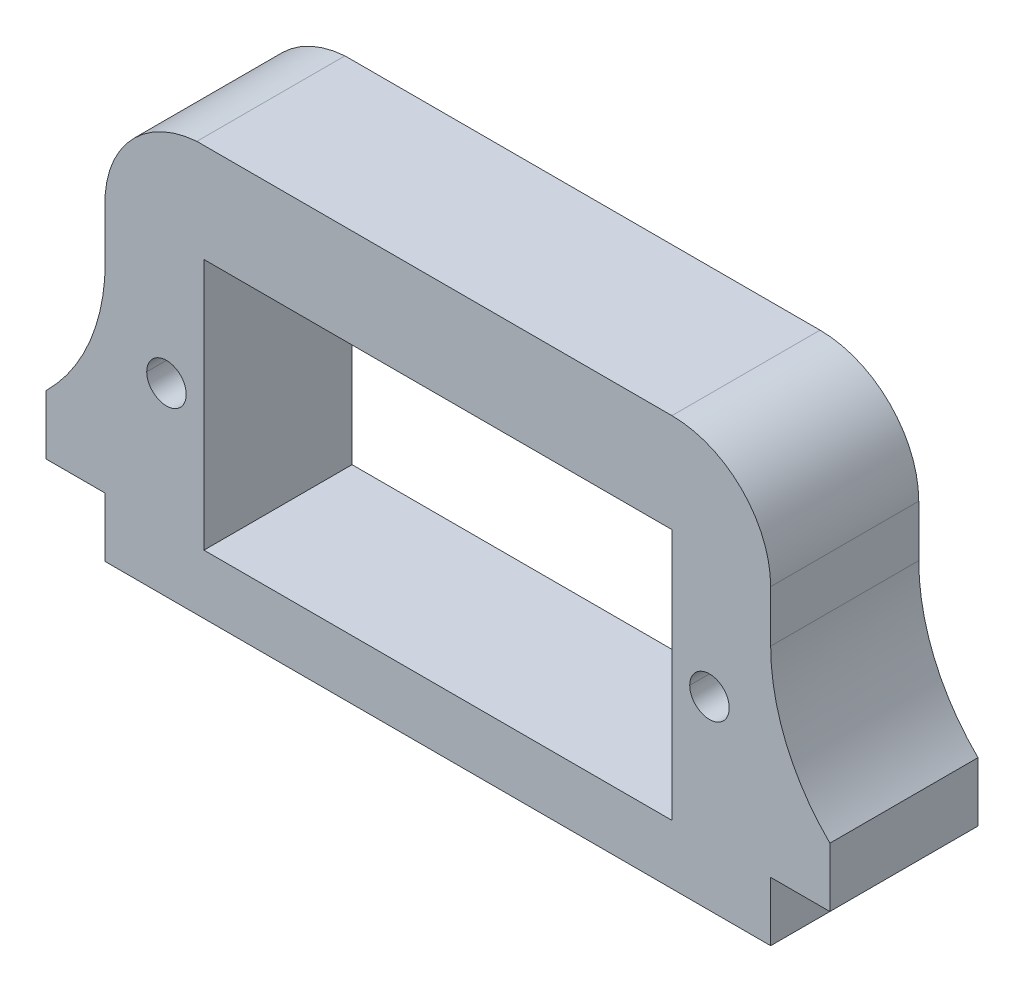
ISO-10303-21;
HEADER;
FILE_DESCRIPTION(('STEP AP214'),'2;1');
FILE_NAME('part.step','',(''),(''),'','','');
FILE_SCHEMA(('AUTOMOTIVE_DESIGN { 1 0 10303 214 1 1 1 1 }'));
ENDSEC;
DATA;
#1=APPLICATION_CONTEXT('core data for automotive mechanical design processes');
#2=APPLICATION_PROTOCOL_DEFINITION('international standard','automotive_design',2000,#1);
#3=PRODUCT_CONTEXT('',#1,'mechanical');
#4=PRODUCT('Part','Part','',(#3));
#5=PRODUCT_RELATED_PRODUCT_CATEGORY('part','',(#4));
#6=PRODUCT_DEFINITION_FORMATION('','',#4);
#7=PRODUCT_DEFINITION_CONTEXT('part definition',#1,'design');
#8=PRODUCT_DEFINITION('design','',#6,#7);
#9=PRODUCT_DEFINITION_SHAPE('','',#8);
#10=(LENGTH_UNIT() NAMED_UNIT(*) SI_UNIT(.MILLI.,.METRE.));
#11=(NAMED_UNIT(*) PLANE_ANGLE_UNIT() SI_UNIT($,.RADIAN.));
#12=(NAMED_UNIT(*) SI_UNIT($,.STERADIAN.) SOLID_ANGLE_UNIT());
#13=UNCERTAINTY_MEASURE_WITH_UNIT(LENGTH_MEASURE(1.E-05),#10,'distance_accuracy_value','');
#14=(GEOMETRIC_REPRESENTATION_CONTEXT(3) GLOBAL_UNCERTAINTY_ASSIGNED_CONTEXT((#13)) GLOBAL_UNIT_ASSIGNED_CONTEXT((#10,
#11,#12)) REPRESENTATION_CONTEXT('',''));
#15=CARTESIAN_POINT('',(0.,0.,0.));
#16=DIRECTION('',(0.,0.,1.));
#17=DIRECTION('',(1.,0.,0.));
#18=AXIS2_PLACEMENT_3D('',#15,#16,#17);
#19=CARTESIAN_POINT('',(-10.,13.1414284285428,7.5));
#20=DIRECTION('',(0.,0.,-1.));
#21=DIRECTION('',(-1.,0.,0.));
#22=AXIS2_PLACEMENT_3D('',#19,#20,#21);
#23=CYLINDRICAL_SURFACE('',#22,10.);
#24=CARTESIAN_POINT('',(-10.,13.1414284285428,7.5));
#25=DIRECTION('',(0.,0.,-1.));
#26=DIRECTION('',(1.,0.,0.));
#27=AXIS2_PLACEMENT_3D('',#24,#25,#26);
#28=CIRCLE('',#27,10.);
#29=CARTESIAN_POINT('',(0.,13.1414284285428,7.5));
#30=VERTEX_POINT('',#29);
#31=CARTESIAN_POINT('',(-3.,6.,7.5));
#32=VERTEX_POINT('',#31);
#33=EDGE_CURVE('E261',#30,#32,#28,.T.);
#34=ORIENTED_EDGE('',*,*,#33,.F.);
#35=DIRECTION('',(0.,0.,1.));
#36=VECTOR('',#35,1.);
#37=CARTESIAN_POINT('',(0.,13.1414284285428,7.5));
#38=LINE('',#37,#36);
#39=CARTESIAN_POINT('',(0.,13.1414284285428,0.));
#40=VERTEX_POINT('',#39);
#41=EDGE_CURVE('E220',#40,#30,#38,.T.);
#42=ORIENTED_EDGE('',*,*,#41,.F.);
#43=CARTESIAN_POINT('',(-10.,13.1414284285428,0.));
#44=DIRECTION('',(0.,0.,1.));
#45=DIRECTION('',(1.,0.,0.));
#46=AXIS2_PLACEMENT_3D('',#43,#44,#45);
#47=CIRCLE('',#46,10.);
#48=CARTESIAN_POINT('',(-3.,6.,0.));
#49=VERTEX_POINT('',#48);
#50=EDGE_CURVE('E218',#49,#40,#47,.T.);
#51=ORIENTED_EDGE('',*,*,#50,.F.);
#52=DIRECTION('',(0.,0.,-1.));
#53=VECTOR('',#52,1.);
#54=CARTESIAN_POINT('',(-3.,6.,7.5));
#55=LINE('',#54,#53);
#56=EDGE_CURVE('E9',#32,#49,#55,.T.);
#57=ORIENTED_EDGE('',*,*,#56,.F.);
#58=EDGE_LOOP('',(#34,#42,#51,#57));
#59=FACE_BOUND('',#58,.T.);
#60=ADVANCED_FACE('F14',(#59),#23,.F.);
#61=CARTESIAN_POINT('',(43.7,13.1414284285429,7.5));
#62=DIRECTION('',(0.,0.,1.));
#63=DIRECTION('',(1.,0.,0.));
#64=AXIS2_PLACEMENT_3D('',#61,#62,#63);
#65=CYLINDRICAL_SURFACE('',#64,10.);
#66=CARTESIAN_POINT('',(43.7,13.1414284285429,7.5));
#67=DIRECTION('',(0.,0.,-1.));
#68=DIRECTION('',(1.,0.,0.));
#69=AXIS2_PLACEMENT_3D('',#66,#67,#68);
#70=CIRCLE('',#69,10.);
#71=CARTESIAN_POINT('',(36.7,6.,7.5));
#72=VERTEX_POINT('',#71);
#73=CARTESIAN_POINT('',(33.7,13.1414284285429,7.5));
#74=VERTEX_POINT('',#73);
#75=EDGE_CURVE('E346',#72,#74,#70,.T.);
#76=ORIENTED_EDGE('',*,*,#75,.F.);
#77=DIRECTION('',(0.,0.,-1.));
#78=VECTOR('',#77,1.);
#79=CARTESIAN_POINT('',(36.7,6.,7.5));
#80=LINE('',#79,#78);
#81=CARTESIAN_POINT('',(36.7,6.,0.));
#82=VERTEX_POINT('',#81);
#83=EDGE_CURVE('E272',#72,#82,#80,.T.);
#84=ORIENTED_EDGE('',*,*,#83,.T.);
#85=CARTESIAN_POINT('',(43.7,13.1414284285429,0.));
#86=DIRECTION('',(0.,0.,1.));
#87=DIRECTION('',(1.,0.,0.));
#88=AXIS2_PLACEMENT_3D('',#85,#86,#87);
#89=CIRCLE('',#88,10.);
#90=CARTESIAN_POINT('',(33.7,13.1414284285429,0.));
#91=VERTEX_POINT('',#90);
#92=EDGE_CURVE('E362',#91,#82,#89,.T.);
#93=ORIENTED_EDGE('',*,*,#92,.F.);
#94=DIRECTION('',(0.,0.,-1.));
#95=VECTOR('',#94,1.);
#96=CARTESIAN_POINT('',(33.7,13.1414284285429,7.5));
#97=LINE('',#96,#95);
#98=EDGE_CURVE('E252',#74,#91,#97,.T.);
#99=ORIENTED_EDGE('',*,*,#98,.F.);
#100=EDGE_LOOP('',(#76,#84,#93,#99));
#101=FACE_BOUND('',#100,.T.);
#102=ADVANCED_FACE('F630',(#101),#65,.F.);
#103=CARTESIAN_POINT('',(-3.,3.,7.5));
#104=DIRECTION('',(-1.,0.,0.));
#105=DIRECTION('',(0.,0.,1.));
#106=AXIS2_PLACEMENT_3D('',#103,#104,#105);
#107=PLANE('',#106);
#108=DIRECTION('',(0.,1.,0.));
#109=VECTOR('',#108,1.);
#110=CARTESIAN_POINT('',(-3.,3.,0.));
#111=LINE('',#110,#109);
#112=CARTESIAN_POINT('',(-3.,3.,0.));
#113=VERTEX_POINT('',#112);
#114=EDGE_CURVE('E210',#113,#49,#111,.T.);
#115=ORIENTED_EDGE('',*,*,#114,.F.);
#116=DIRECTION('',(0.,0.,-1.));
#117=VECTOR('',#116,1.);
#118=CARTESIAN_POINT('',(-3.,3.,7.5));
#119=LINE('',#118,#117);
#120=CARTESIAN_POINT('',(-3.,3.,7.5));
#121=VERTEX_POINT('',#120);
#122=EDGE_CURVE('E24',#121,#113,#119,.T.);
#123=ORIENTED_EDGE('',*,*,#122,.F.);
#124=DIRECTION('',(0.,1.,0.));
#125=VECTOR('',#124,1.);
#126=CARTESIAN_POINT('',(-3.,3.,7.5));
#127=LINE('',#126,#125);
#128=EDGE_CURVE('E213',#121,#32,#127,.T.);
#129=ORIENTED_EDGE('',*,*,#128,.T.);
#130=ORIENTED_EDGE('',*,*,#56,.T.);
#131=EDGE_LOOP('',(#115,#123,#129,#130));
#132=FACE_BOUND('',#131,.T.);
#133=ADVANCED_FACE('F208',(#132),#107,.T.);
#134=CARTESIAN_POINT('',(0.,3.,7.5));
#135=DIRECTION('',(0.,-1.,0.));
#136=DIRECTION('',(0.,0.,-1.));
#137=AXIS2_PLACEMENT_3D('',#134,#135,#136);
#138=PLANE('',#137);
#139=DIRECTION('',(-1.,0.,0.));
#140=VECTOR('',#139,1.);
#141=CARTESIAN_POINT('',(0.,3.,0.));
#142=LINE('',#141,#140);
#143=CARTESIAN_POINT('',(0.,3.,0.));
#144=VERTEX_POINT('',#143);
#145=EDGE_CURVE('E228',#144,#113,#142,.T.);
#146=ORIENTED_EDGE('',*,*,#145,.F.);
#147=DIRECTION('',(0.,0.,-1.));
#148=VECTOR('',#147,1.);
#149=CARTESIAN_POINT('',(0.,3.,7.5));
#150=LINE('',#149,#148);
#151=CARTESIAN_POINT('',(0.,3.,7.5));
#152=VERTEX_POINT('',#151);
#153=EDGE_CURVE('E38',#152,#144,#150,.T.);
#154=ORIENTED_EDGE('',*,*,#153,.F.);
#155=DIRECTION('',(-1.,0.,0.));
#156=VECTOR('',#155,1.);
#157=CARTESIAN_POINT('',(0.,3.,7.5));
#158=LINE('',#157,#156);
#159=EDGE_CURVE('E388',#152,#121,#158,.T.);
#160=ORIENTED_EDGE('',*,*,#159,.T.);
#161=ORIENTED_EDGE('',*,*,#122,.T.);
#162=EDGE_LOOP('',(#146,#154,#160,#161));
#163=FACE_BOUND('',#162,.T.);
#164=ADVANCED_FACE('F406',(#163),#138,.T.);
#165=CARTESIAN_POINT('',(0.,0.,7.5));
#166=DIRECTION('',(-1.,0.,0.));
#167=DIRECTION('',(0.,0.,1.));
#168=AXIS2_PLACEMENT_3D('',#165,#166,#167);
#169=PLANE('',#168);
#170=DIRECTION('',(0.,1.,0.));
#171=VECTOR('',#170,1.);
#172=CARTESIAN_POINT('',(0.,0.,0.));
#173=LINE('',#172,#171);
#174=CARTESIAN_POINT('',(0.,16.1104121770289,0.));
#175=VERTEX_POINT('',#174);
#176=EDGE_CURVE('E224',#40,#175,#173,.T.);
#177=ORIENTED_EDGE('',*,*,#176,.F.);
#178=ORIENTED_EDGE('',*,*,#41,.T.);
#179=DIRECTION('',(0.,1.,0.));
#180=VECTOR('',#179,1.);
#181=CARTESIAN_POINT('',(0.,0.,7.5));
#182=LINE('',#181,#180);
#183=CARTESIAN_POINT('',(0.,16.1104121770289,7.5));
#184=VERTEX_POINT('',#183);
#185=EDGE_CURVE('E258',#30,#184,#182,.T.);
#186=ORIENTED_EDGE('',*,*,#185,.T.);
#187=DIRECTION('',(0.,0.,-1.));
#188=VECTOR('',#187,1.);
#189=CARTESIAN_POINT('',(0.,16.1104121770289,7.5));
#190=LINE('',#189,#188);
#191=EDGE_CURVE('E245',#184,#175,#190,.T.);
#192=ORIENTED_EDGE('',*,*,#191,.T.);
#193=EDGE_LOOP('',(#177,#178,#186,#192));
#194=FACE_BOUND('',#193,.T.);
#195=ADVANCED_FACE('F666',(#194),#169,.T.);
#196=CARTESIAN_POINT('',(0.,0.,7.5));
#197=DIRECTION('',(-1.,0.,0.));
#198=DIRECTION('',(0.,0.,1.));
#199=AXIS2_PLACEMENT_3D('',#196,#197,#198);
#200=PLANE('',#199);
#201=DIRECTION('',(0.,1.,0.));
#202=VECTOR('',#201,1.);
#203=CARTESIAN_POINT('',(0.,0.,7.5));
#204=LINE('',#203,#202);
#205=CARTESIAN_POINT('',(0.,0.,7.5));
#206=VERTEX_POINT('',#205);
#207=EDGE_CURVE('E349',#206,#152,#204,.T.);
#208=ORIENTED_EDGE('',*,*,#207,.T.);
#209=ORIENTED_EDGE('',*,*,#153,.T.);
#210=DIRECTION('',(0.,1.,0.));
#211=VECTOR('',#210,1.);
#212=CARTESIAN_POINT('',(0.,0.,0.));
#213=LINE('',#212,#211);
#214=CARTESIAN_POINT('',(0.,0.,0.));
#215=VERTEX_POINT('',#214);
#216=EDGE_CURVE('E236',#215,#144,#213,.T.);
#217=ORIENTED_EDGE('',*,*,#216,.F.);
#218=DIRECTION('',(0.,0.,-1.));
#219=VECTOR('',#218,1.);
#220=CARTESIAN_POINT('',(0.,0.,7.5));
#221=LINE('',#220,#219);
#222=EDGE_CURVE('E358',#206,#215,#221,.T.);
#223=ORIENTED_EDGE('',*,*,#222,.F.);
#224=EDGE_LOOP('',(#208,#209,#217,#223));
#225=FACE_BOUND('',#224,.T.);
#226=ADVANCED_FACE('F403',(#225),#200,.T.);
#227=CARTESIAN_POINT('',(0.,0.,7.5));
#228=DIRECTION('',(0.,0.,1.));
#229=DIRECTION('',(1.,0.,0.));
#230=AXIS2_PLACEMENT_3D('',#227,#228,#229);
#231=PLANE('',#230);
#232=DIRECTION('',(0.,1.,0.));
#233=VECTOR('',#232,1.);
#234=CARTESIAN_POINT('',(28.7,0.,7.5));
#235=LINE('',#234,#233);
#236=CARTESIAN_POINT('',(28.7,3.,7.5));
#237=VERTEX_POINT('',#236);
#238=CARTESIAN_POINT('',(28.7,15.75,7.5));
#239=VERTEX_POINT('',#238);
#240=EDGE_CURVE('E262',#237,#239,#235,.T.);
#241=ORIENTED_EDGE('',*,*,#240,.F.);
#242=DIRECTION('',(1.,0.,0.));
#243=VECTOR('',#242,1.);
#244=CARTESIAN_POINT('',(0.,3.,7.5));
#245=LINE('',#244,#243);
#246=CARTESIAN_POINT('',(5.,3.,7.5));
#247=VERTEX_POINT('',#246);
#248=EDGE_CURVE('E312',#247,#237,#245,.T.);
#249=ORIENTED_EDGE('',*,*,#248,.F.);
#250=DIRECTION('',(0.,1.,0.));
#251=VECTOR('',#250,1.);
#252=CARTESIAN_POINT('',(5.,0.,7.5));
#253=LINE('',#252,#251);
#254=CARTESIAN_POINT('',(5.,15.75,7.5));
#255=VERTEX_POINT('',#254);
#256=EDGE_CURVE('E276',#247,#255,#253,.T.);
#257=ORIENTED_EDGE('',*,*,#256,.T.);
#258=DIRECTION('',(1.,0.,0.));
#259=VECTOR('',#258,1.);
#260=CARTESIAN_POINT('',(0.,15.75,7.5));
#261=LINE('',#260,#259);
#262=EDGE_CURVE('E329',#255,#239,#261,.T.);
#263=ORIENTED_EDGE('',*,*,#262,.T.);
#264=EDGE_LOOP('',(#241,#249,#257,#263));
#265=FACE_BOUND('',#264,.T.);
#266=CARTESIAN_POINT('',(3.1,9.375,7.5));
#267=DIRECTION('',(0.,0.,1.));
#268=DIRECTION('',(1.,0.,0.));
#269=AXIS2_PLACEMENT_3D('',#266,#267,#268);
#270=CIRCLE('',#269,1.);
#271=CARTESIAN_POINT('',(2.1,9.375,7.5));
#272=VERTEX_POINT('',#271);
#273=CARTESIAN_POINT('',(4.1,9.375,7.5));
#274=VERTEX_POINT('',#273);
#275=EDGE_CURVE('E291',#272,#274,#270,.T.);
#276=ORIENTED_EDGE('',*,*,#275,.F.);
#277=CARTESIAN_POINT('',(3.1,9.375,7.5));
#278=DIRECTION('',(0.,0.,1.));
#279=DIRECTION('',(1.,0.,0.));
#280=AXIS2_PLACEMENT_3D('',#277,#278,#279);
#281=CIRCLE('',#280,1.);
#282=EDGE_CURVE('E265',#274,#272,#281,.T.);
#283=ORIENTED_EDGE('',*,*,#282,.F.);
#284=EDGE_LOOP('',(#276,#283));
#285=FACE_BOUND('',#284,.T.);
#286=CARTESIAN_POINT('',(30.6,9.375,7.5));
#287=DIRECTION('',(0.,0.,1.));
#288=DIRECTION('',(1.,0.,0.));
#289=AXIS2_PLACEMENT_3D('',#286,#287,#288);
#290=CIRCLE('',#289,1.);
#291=CARTESIAN_POINT('',(29.6,9.375,7.5));
#292=VERTEX_POINT('',#291);
#293=CARTESIAN_POINT('',(31.6,9.375,7.5));
#294=VERTEX_POINT('',#293);
#295=EDGE_CURVE('E384',#292,#294,#290,.T.);
#296=ORIENTED_EDGE('',*,*,#295,.F.);
#297=CARTESIAN_POINT('',(30.6,9.375,7.5));
#298=DIRECTION('',(0.,0.,1.));
#299=DIRECTION('',(1.,0.,0.));
#300=AXIS2_PLACEMENT_3D('',#297,#298,#299);
#301=CIRCLE('',#300,1.);
#302=EDGE_CURVE('E320',#294,#292,#301,.T.);
#303=ORIENTED_EDGE('',*,*,#302,.F.);
#304=EDGE_LOOP('',(#296,#303));
#305=FACE_BOUND('',#304,.T.);
#306=CARTESIAN_POINT('',(28.7,15.75,7.5));
#307=DIRECTION('',(0.,0.,-1.));
#308=DIRECTION('',(1.,0.,0.));
#309=AXIS2_PLACEMENT_3D('',#306,#307,#308);
#310=CIRCLE('',#309,5.);
#311=CARTESIAN_POINT('',(28.7,20.75,7.5));
#312=VERTEX_POINT('',#311);
#313=CARTESIAN_POINT('',(33.7,15.75,7.5));
#314=VERTEX_POINT('',#313);
#315=EDGE_CURVE('E297',#312,#314,#310,.T.);
#316=ORIENTED_EDGE('',*,*,#315,.F.);
#317=DIRECTION('',(1.,0.,0.));
#318=VECTOR('',#317,1.);
#319=CARTESIAN_POINT('',(0.,20.75,7.5));
#320=LINE('',#319,#318);
#321=CARTESIAN_POINT('',(4.63958782297116,20.75,7.5));
#322=VERTEX_POINT('',#321);
#323=EDGE_CURVE('E251',#322,#312,#320,.T.);
#324=ORIENTED_EDGE('',*,*,#323,.F.);
#325=CARTESIAN_POINT('',(5.,15.75,7.5));
#326=DIRECTION('',(0.,0.,-1.));
#327=DIRECTION('',(1.,0.,0.));
#328=AXIS2_PLACEMENT_3D('',#325,#326,#327);
#329=CIRCLE('',#328,5.01297286421448);
#330=EDGE_CURVE('E242',#184,#322,#329,.T.);
#331=ORIENTED_EDGE('',*,*,#330,.F.);
#332=ORIENTED_EDGE('',*,*,#185,.F.);
#333=ORIENTED_EDGE('',*,*,#33,.T.);
#334=ORIENTED_EDGE('',*,*,#128,.F.);
#335=ORIENTED_EDGE('',*,*,#159,.F.);
#336=ORIENTED_EDGE('',*,*,#207,.F.);
#337=DIRECTION('',(1.,0.,0.));
#338=VECTOR('',#337,1.);
#339=CARTESIAN_POINT('',(0.,0.,7.5));
#340=LINE('',#339,#338);
#341=CARTESIAN_POINT('',(33.7,0.,7.5));
#342=VERTEX_POINT('',#341);
#343=EDGE_CURVE('E363',#206,#342,#340,.T.);
#344=ORIENTED_EDGE('',*,*,#343,.T.);
#345=DIRECTION('',(0.,1.,0.));
#346=VECTOR('',#345,1.);
#347=CARTESIAN_POINT('',(33.7,0.,7.5));
#348=LINE('',#347,#346);
#349=CARTESIAN_POINT('',(33.7,3.,7.5));
#350=VERTEX_POINT('',#349);
#351=EDGE_CURVE('E278',#342,#350,#348,.T.);
#352=ORIENTED_EDGE('',*,*,#351,.T.);
#353=DIRECTION('',(1.,0.,0.));
#354=VECTOR('',#353,1.);
#355=CARTESIAN_POINT('',(0.,3.,7.5));
#356=LINE('',#355,#354);
#357=CARTESIAN_POINT('',(36.7,3.,7.5));
#358=VERTEX_POINT('',#357);
#359=EDGE_CURVE('E326',#350,#358,#356,.T.);
#360=ORIENTED_EDGE('',*,*,#359,.T.);
#361=DIRECTION('',(0.,1.,0.));
#362=VECTOR('',#361,1.);
#363=CARTESIAN_POINT('',(36.7,0.,7.5));
#364=LINE('',#363,#362);
#365=EDGE_CURVE('E267',#358,#72,#364,.T.);
#366=ORIENTED_EDGE('',*,*,#365,.T.);
#367=ORIENTED_EDGE('',*,*,#75,.T.);
#368=DIRECTION('',(0.,1.,0.));
#369=VECTOR('',#368,1.);
#370=CARTESIAN_POINT('',(33.7,0.,7.5));
#371=LINE('',#370,#369);
#372=EDGE_CURVE('E257',#74,#314,#371,.T.);
#373=ORIENTED_EDGE('',*,*,#372,.T.);
#374=EDGE_LOOP('',(#316,#324,#331,#332,#333,#334,#335,#336,#344,#352,#360,#366,#367,#373));
#375=FACE_BOUND('',#374,.T.);
#376=ADVANCED_FACE('F618',(#265,#285,#305,#375),#231,.T.);
#377=CARTESIAN_POINT('',(0.,0.,0.));
#378=DIRECTION('',(0.,0.,1.));
#379=DIRECTION('',(1.,0.,0.));
#380=AXIS2_PLACEMENT_3D('',#377,#378,#379);
#381=PLANE('',#380);
#382=DIRECTION('',(0.,1.,0.));
#383=VECTOR('',#382,1.);
#384=CARTESIAN_POINT('',(28.7,0.,0.));
#385=LINE('',#384,#383);
#386=CARTESIAN_POINT('',(28.7,3.,0.));
#387=VERTEX_POINT('',#386);
#388=CARTESIAN_POINT('',(28.7,15.75,0.));
#389=VERTEX_POINT('',#388);
#390=EDGE_CURVE('E266',#387,#389,#385,.T.);
#391=ORIENTED_EDGE('',*,*,#390,.T.);
#392=DIRECTION('',(1.,0.,0.));
#393=VECTOR('',#392,1.);
#394=CARTESIAN_POINT('',(0.,15.75,0.));
#395=LINE('',#394,#393);
#396=CARTESIAN_POINT('',(5.,15.75,0.));
#397=VERTEX_POINT('',#396);
#398=EDGE_CURVE('E370',#397,#389,#395,.T.);
#399=ORIENTED_EDGE('',*,*,#398,.F.);
#400=DIRECTION('',(0.,1.,0.));
#401=VECTOR('',#400,1.);
#402=CARTESIAN_POINT('',(5.,0.,0.));
#403=LINE('',#402,#401);
#404=CARTESIAN_POINT('',(5.,3.,0.));
#405=VERTEX_POINT('',#404);
#406=EDGE_CURVE('E273',#405,#397,#403,.T.);
#407=ORIENTED_EDGE('',*,*,#406,.F.);
#408=DIRECTION('',(1.,0.,0.));
#409=VECTOR('',#408,1.);
#410=CARTESIAN_POINT('',(0.,3.,0.));
#411=LINE('',#410,#409);
#412=EDGE_CURVE('E287',#405,#387,#411,.T.);
#413=ORIENTED_EDGE('',*,*,#412,.T.);
#414=EDGE_LOOP('',(#391,#399,#407,#413));
#415=FACE_BOUND('',#414,.T.);
#416=CARTESIAN_POINT('',(3.1,9.375,0.));
#417=DIRECTION('',(0.,0.,1.));
#418=DIRECTION('',(1.,0.,0.));
#419=AXIS2_PLACEMENT_3D('',#416,#417,#418);
#420=CIRCLE('',#419,1.);
#421=CARTESIAN_POINT('',(2.1,9.375,0.));
#422=VERTEX_POINT('',#421);
#423=CARTESIAN_POINT('',(4.1,9.375,0.));
#424=VERTEX_POINT('',#423);
#425=EDGE_CURVE('E355',#422,#424,#420,.T.);
#426=ORIENTED_EDGE('',*,*,#425,.T.);
#427=CARTESIAN_POINT('',(3.1,9.375,0.));
#428=DIRECTION('',(0.,0.,1.));
#429=DIRECTION('',(1.,0.,0.));
#430=AXIS2_PLACEMENT_3D('',#427,#428,#429);
#431=CIRCLE('',#430,1.);
#432=EDGE_CURVE('E393',#424,#422,#431,.T.);
#433=ORIENTED_EDGE('',*,*,#432,.T.);
#434=EDGE_LOOP('',(#426,#433));
#435=FACE_BOUND('',#434,.T.);
#436=CARTESIAN_POINT('',(30.6,9.375,0.));
#437=DIRECTION('',(0.,0.,1.));
#438=DIRECTION('',(1.,0.,0.));
#439=AXIS2_PLACEMENT_3D('',#436,#437,#438);
#440=CIRCLE('',#439,1.);
#441=CARTESIAN_POINT('',(29.6,9.375,0.));
#442=VERTEX_POINT('',#441);
#443=CARTESIAN_POINT('',(31.6,9.375,0.));
#444=VERTEX_POINT('',#443);
#445=EDGE_CURVE('E321',#442,#444,#440,.T.);
#446=ORIENTED_EDGE('',*,*,#445,.T.);
#447=CARTESIAN_POINT('',(30.6,9.375,0.));
#448=DIRECTION('',(0.,0.,1.));
#449=DIRECTION('',(1.,0.,0.));
#450=AXIS2_PLACEMENT_3D('',#447,#448,#449);
#451=CIRCLE('',#450,1.);
#452=EDGE_CURVE('E317',#444,#442,#451,.T.);
#453=ORIENTED_EDGE('',*,*,#452,.T.);
#454=EDGE_LOOP('',(#446,#453));
#455=FACE_BOUND('',#454,.T.);
#456=CARTESIAN_POINT('',(28.7,15.75,0.));
#457=DIRECTION('',(0.,0.,-1.));
#458=DIRECTION('',(1.,0.,0.));
#459=AXIS2_PLACEMENT_3D('',#456,#457,#458);
#460=CIRCLE('',#459,5.);
#461=CARTESIAN_POINT('',(28.7,20.75,0.));
#462=VERTEX_POINT('',#461);
#463=CARTESIAN_POINT('',(33.7,15.75,0.));
#464=VERTEX_POINT('',#463);
#465=EDGE_CURVE('E250',#462,#464,#460,.T.);
#466=ORIENTED_EDGE('',*,*,#465,.T.);
#467=DIRECTION('',(0.,1.,0.));
#468=VECTOR('',#467,1.);
#469=CARTESIAN_POINT('',(33.7,0.,0.));
#470=LINE('',#469,#468);
#471=EDGE_CURVE('E256',#91,#464,#470,.T.);
#472=ORIENTED_EDGE('',*,*,#471,.F.);
#473=ORIENTED_EDGE('',*,*,#92,.T.);
#474=DIRECTION('',(0.,1.,0.));
#475=VECTOR('',#474,1.);
#476=CARTESIAN_POINT('',(36.7,0.,0.));
#477=LINE('',#476,#475);
#478=CARTESIAN_POINT('',(36.7,3.,0.));
#479=VERTEX_POINT('',#478);
#480=EDGE_CURVE('E308',#479,#82,#477,.T.);
#481=ORIENTED_EDGE('',*,*,#480,.F.);
#482=DIRECTION('',(1.,0.,0.));
#483=VECTOR('',#482,1.);
#484=CARTESIAN_POINT('',(0.,3.,0.));
#485=LINE('',#484,#483);
#486=CARTESIAN_POINT('',(33.7,3.,0.));
#487=VERTEX_POINT('',#486);
#488=EDGE_CURVE('E304',#487,#479,#485,.T.);
#489=ORIENTED_EDGE('',*,*,#488,.F.);
#490=DIRECTION('',(0.,1.,0.));
#491=VECTOR('',#490,1.);
#492=CARTESIAN_POINT('',(33.7,0.,0.));
#493=LINE('',#492,#491);
#494=CARTESIAN_POINT('',(33.7,0.,0.));
#495=VERTEX_POINT('',#494);
#496=EDGE_CURVE('E282',#495,#487,#493,.T.);
#497=ORIENTED_EDGE('',*,*,#496,.F.);
#498=DIRECTION('',(1.,0.,0.));
#499=VECTOR('',#498,1.);
#500=CARTESIAN_POINT('',(0.,0.,0.));
#501=LINE('',#500,#499);
#502=EDGE_CURVE('E244',#215,#495,#501,.T.);
#503=ORIENTED_EDGE('',*,*,#502,.F.);
#504=ORIENTED_EDGE('',*,*,#216,.T.);
#505=ORIENTED_EDGE('',*,*,#145,.T.);
#506=ORIENTED_EDGE('',*,*,#114,.T.);
#507=ORIENTED_EDGE('',*,*,#50,.T.);
#508=ORIENTED_EDGE('',*,*,#176,.T.);
#509=CARTESIAN_POINT('',(5.,15.75,0.));
#510=DIRECTION('',(0.,0.,-1.));
#511=DIRECTION('',(1.,0.,0.));
#512=AXIS2_PLACEMENT_3D('',#509,#510,#511);
#513=CIRCLE('',#512,5.01297286421448);
#514=CARTESIAN_POINT('',(4.63958782297116,20.75,0.));
#515=VERTEX_POINT('',#514);
#516=EDGE_CURVE('E299',#175,#515,#513,.T.);
#517=ORIENTED_EDGE('',*,*,#516,.T.);
#518=DIRECTION('',(1.,0.,0.));
#519=VECTOR('',#518,1.);
#520=CARTESIAN_POINT('',(0.,20.75,0.));
#521=LINE('',#520,#519);
#522=EDGE_CURVE('E420',#515,#462,#521,.T.);
#523=ORIENTED_EDGE('',*,*,#522,.T.);
#524=EDGE_LOOP('',(#466,#472,#473,#481,#489,#497,#503,#504,#505,#506,#507,#508,#517,#523));
#525=FACE_BOUND('',#524,.T.);
#526=ADVANCED_FACE('F226',(#415,#435,#455,#525),#381,.F.);
#527=CARTESIAN_POINT('',(0.,0.,7.5));
#528=DIRECTION('',(0.,1.,0.));
#529=DIRECTION('',(1.,0.,0.));
#530=AXIS2_PLACEMENT_3D('',#527,#528,#529);
#531=PLANE('',#530);
#532=ORIENTED_EDGE('',*,*,#502,.T.);
#533=DIRECTION('',(0.,0.,-1.));
#534=VECTOR('',#533,1.);
#535=CARTESIAN_POINT('',(33.7,0.,7.5));
#536=LINE('',#535,#534);
#537=EDGE_CURVE('E281',#342,#495,#536,.T.);
#538=ORIENTED_EDGE('',*,*,#537,.F.);
#539=ORIENTED_EDGE('',*,*,#343,.F.);
#540=ORIENTED_EDGE('',*,*,#222,.T.);
#541=EDGE_LOOP('',(#532,#538,#539,#540));
#542=FACE_BOUND('',#541,.T.);
#543=ADVANCED_FACE('F413',(#542),#531,.F.);
#544=CARTESIAN_POINT('',(5.,15.75,7.5));
#545=DIRECTION('',(0.,0.,-1.));
#546=DIRECTION('',(-1.,0.,0.));
#547=AXIS2_PLACEMENT_3D('',#544,#545,#546);
#548=CYLINDRICAL_SURFACE('',#547,5.01297286421448);
#549=ORIENTED_EDGE('',*,*,#516,.F.);
#550=ORIENTED_EDGE('',*,*,#191,.F.);
#551=ORIENTED_EDGE('',*,*,#330,.T.);
#552=DIRECTION('',(0.,0.,-1.));
#553=VECTOR('',#552,1.);
#554=CARTESIAN_POINT('',(4.63958782297116,20.75,7.5));
#555=LINE('',#554,#553);
#556=EDGE_CURVE('E428',#322,#515,#555,.T.);
#557=ORIENTED_EDGE('',*,*,#556,.T.);
#558=EDGE_LOOP('',(#549,#550,#551,#557));
#559=FACE_BOUND('',#558,.T.);
#560=ADVANCED_FACE('F683',(#559),#548,.T.);
#561=CARTESIAN_POINT('',(28.7,15.75,7.5));
#562=DIRECTION('',(0.,0.,-1.));
#563=DIRECTION('',(-1.,0.,0.));
#564=AXIS2_PLACEMENT_3D('',#561,#562,#563);
#565=CYLINDRICAL_SURFACE('',#564,5.);
#566=ORIENTED_EDGE('',*,*,#465,.F.);
#567=DIRECTION('',(0.,0.,-1.));
#568=VECTOR('',#567,1.);
#569=CARTESIAN_POINT('',(28.7,20.75,7.5));
#570=LINE('',#569,#568);
#571=EDGE_CURVE('E246',#312,#462,#570,.T.);
#572=ORIENTED_EDGE('',*,*,#571,.F.);
#573=ORIENTED_EDGE('',*,*,#315,.T.);
#574=DIRECTION('',(0.,0.,-1.));
#575=VECTOR('',#574,1.);
#576=CARTESIAN_POINT('',(33.7,15.75,7.5));
#577=LINE('',#576,#575);
#578=EDGE_CURVE('E240',#314,#464,#577,.T.);
#579=ORIENTED_EDGE('',*,*,#578,.T.);
#580=EDGE_LOOP('',(#566,#572,#573,#579));
#581=FACE_BOUND('',#580,.T.);
#582=ADVANCED_FACE('F678',(#581),#565,.T.);
#583=CARTESIAN_POINT('',(0.,20.75,7.5));
#584=DIRECTION('',(0.,1.,0.));
#585=DIRECTION('',(1.,0.,0.));
#586=AXIS2_PLACEMENT_3D('',#583,#584,#585);
#587=PLANE('',#586);
#588=ORIENTED_EDGE('',*,*,#522,.F.);
#589=ORIENTED_EDGE('',*,*,#556,.F.);
#590=ORIENTED_EDGE('',*,*,#323,.T.);
#591=ORIENTED_EDGE('',*,*,#571,.T.);
#592=EDGE_LOOP('',(#588,#589,#590,#591));
#593=FACE_BOUND('',#592,.T.);
#594=ADVANCED_FACE('F682',(#593),#587,.T.);
#595=CARTESIAN_POINT('',(33.7,0.,7.5));
#596=DIRECTION('',(-1.,0.,0.));
#597=DIRECTION('',(0.,0.,1.));
#598=AXIS2_PLACEMENT_3D('',#595,#596,#597);
#599=PLANE('',#598);
#600=ORIENTED_EDGE('',*,*,#496,.T.);
#601=DIRECTION('',(0.,0.,-1.));
#602=VECTOR('',#601,1.);
#603=CARTESIAN_POINT('',(33.7,3.,7.5));
#604=LINE('',#603,#602);
#605=EDGE_CURVE('E290',#350,#487,#604,.T.);
#606=ORIENTED_EDGE('',*,*,#605,.F.);
#607=ORIENTED_EDGE('',*,*,#351,.F.);
#608=ORIENTED_EDGE('',*,*,#537,.T.);
#609=EDGE_LOOP('',(#600,#606,#607,#608));
#610=FACE_BOUND('',#609,.T.);
#611=ADVANCED_FACE('F417',(#610),#599,.F.);
#612=CARTESIAN_POINT('',(0.,3.,7.5));
#613=DIRECTION('',(0.,1.,0.));
#614=DIRECTION('',(1.,0.,0.));
#615=AXIS2_PLACEMENT_3D('',#612,#613,#614);
#616=PLANE('',#615);
#617=ORIENTED_EDGE('',*,*,#488,.T.);
#618=DIRECTION('',(0.,0.,-1.));
#619=VECTOR('',#618,1.);
#620=CARTESIAN_POINT('',(36.7,3.,7.5));
#621=LINE('',#620,#619);
#622=EDGE_CURVE('E271',#358,#479,#621,.T.);
#623=ORIENTED_EDGE('',*,*,#622,.F.);
#624=ORIENTED_EDGE('',*,*,#359,.F.);
#625=ORIENTED_EDGE('',*,*,#605,.T.);
#626=EDGE_LOOP('',(#617,#623,#624,#625));
#627=FACE_BOUND('',#626,.T.);
#628=ADVANCED_FACE('F740',(#627),#616,.F.);
#629=CARTESIAN_POINT('',(36.7,0.,7.5));
#630=DIRECTION('',(-1.,0.,0.));
#631=DIRECTION('',(0.,0.,1.));
#632=AXIS2_PLACEMENT_3D('',#629,#630,#631);
#633=PLANE('',#632);
#634=ORIENTED_EDGE('',*,*,#480,.T.);
#635=ORIENTED_EDGE('',*,*,#83,.F.);
#636=ORIENTED_EDGE('',*,*,#365,.F.);
#637=ORIENTED_EDGE('',*,*,#622,.T.);
#638=EDGE_LOOP('',(#634,#635,#636,#637));
#639=FACE_BOUND('',#638,.T.);
#640=ADVANCED_FACE('F16',(#639),#633,.F.);
#641=CARTESIAN_POINT('',(33.7,0.,7.5));
#642=DIRECTION('',(-1.,0.,0.));
#643=DIRECTION('',(0.,0.,1.));
#644=AXIS2_PLACEMENT_3D('',#641,#642,#643);
#645=PLANE('',#644);
#646=ORIENTED_EDGE('',*,*,#372,.F.);
#647=ORIENTED_EDGE('',*,*,#98,.T.);
#648=ORIENTED_EDGE('',*,*,#471,.T.);
#649=ORIENTED_EDGE('',*,*,#578,.F.);
#650=EDGE_LOOP('',(#646,#647,#648,#649));
#651=FACE_BOUND('',#650,.T.);
#652=ADVANCED_FACE('F702',(#651),#645,.F.);
#653=CARTESIAN_POINT('',(30.6,9.375,7.5));
#654=DIRECTION('',(0.,0.,-1.));
#655=DIRECTION('',(-1.,0.,0.));
#656=AXIS2_PLACEMENT_3D('',#653,#654,#655);
#657=CYLINDRICAL_SURFACE('',#656,1.);
#658=DIRECTION('',(0.,0.,-1.));
#659=VECTOR('',#658,1.);
#660=CARTESIAN_POINT('',(31.6,9.375,7.5));
#661=LINE('',#660,#659);
#662=EDGE_CURVE('E325',#294,#444,#661,.T.);
#663=ORIENTED_EDGE('',*,*,#662,.F.);
#664=ORIENTED_EDGE('',*,*,#302,.T.);
#665=DIRECTION('',(0.,0.,-1.));
#666=VECTOR('',#665,1.);
#667=CARTESIAN_POINT('',(29.6,9.375,7.5));
#668=LINE('',#667,#666);
#669=EDGE_CURVE('E296',#292,#442,#668,.T.);
#670=ORIENTED_EDGE('',*,*,#669,.T.);
#671=ORIENTED_EDGE('',*,*,#452,.F.);
#672=EDGE_LOOP('',(#663,#664,#670,#671));
#673=FACE_BOUND('',#672,.T.);
#674=ADVANCED_FACE('F698',(#673),#657,.F.);
#675=CARTESIAN_POINT('',(3.1,9.375,7.5));
#676=DIRECTION('',(0.,0.,-1.));
#677=DIRECTION('',(-1.,0.,0.));
#678=AXIS2_PLACEMENT_3D('',#675,#676,#677);
#679=CYLINDRICAL_SURFACE('',#678,1.);
#680=DIRECTION('',(0.,0.,-1.));
#681=VECTOR('',#680,1.);
#682=CARTESIAN_POINT('',(4.1,9.375,7.5));
#683=LINE('',#682,#681);
#684=EDGE_CURVE('E295',#274,#424,#683,.T.);
#685=ORIENTED_EDGE('',*,*,#684,.F.);
#686=ORIENTED_EDGE('',*,*,#282,.T.);
#687=DIRECTION('',(0.,0.,-1.));
#688=VECTOR('',#687,1.);
#689=CARTESIAN_POINT('',(2.1,9.375,7.5));
#690=LINE('',#689,#688);
#691=EDGE_CURVE('E374',#272,#422,#690,.T.);
#692=ORIENTED_EDGE('',*,*,#691,.T.);
#693=ORIENTED_EDGE('',*,*,#432,.F.);
#694=EDGE_LOOP('',(#685,#686,#692,#693));
#695=FACE_BOUND('',#694,.T.);
#696=ADVANCED_FACE('F650',(#695),#679,.F.);
#697=CARTESIAN_POINT('',(28.7,0.,7.5));
#698=DIRECTION('',(-1.,0.,0.));
#699=DIRECTION('',(0.,0.,1.));
#700=AXIS2_PLACEMENT_3D('',#697,#698,#699);
#701=PLANE('',#700);
#702=ORIENTED_EDGE('',*,*,#390,.F.);
#703=DIRECTION('',(0.,0.,-1.));
#704=VECTOR('',#703,1.);
#705=CARTESIAN_POINT('',(28.7,3.,7.5));
#706=LINE('',#705,#704);
#707=EDGE_CURVE('E313',#237,#387,#706,.T.);
#708=ORIENTED_EDGE('',*,*,#707,.F.);
#709=ORIENTED_EDGE('',*,*,#240,.T.);
#710=DIRECTION('',(0.,0.,-1.));
#711=VECTOR('',#710,1.);
#712=CARTESIAN_POINT('',(28.7,15.75,7.5));
#713=LINE('',#712,#711);
#714=EDGE_CURVE('E333',#239,#389,#713,.T.);
#715=ORIENTED_EDGE('',*,*,#714,.T.);
#716=EDGE_LOOP('',(#702,#708,#709,#715));
#717=FACE_BOUND('',#716,.T.);
#718=ADVANCED_FACE('F646',(#717),#701,.T.);
#719=CARTESIAN_POINT('',(0.,3.,7.5));
#720=DIRECTION('',(0.,1.,0.));
#721=DIRECTION('',(1.,0.,0.));
#722=AXIS2_PLACEMENT_3D('',#719,#720,#721);
#723=PLANE('',#722);
#724=ORIENTED_EDGE('',*,*,#412,.F.);
#725=DIRECTION('',(0.,0.,-1.));
#726=VECTOR('',#725,1.);
#727=CARTESIAN_POINT('',(5.,3.,7.5));
#728=LINE('',#727,#726);
#729=EDGE_CURVE('E283',#247,#405,#728,.T.);
#730=ORIENTED_EDGE('',*,*,#729,.F.);
#731=ORIENTED_EDGE('',*,*,#248,.T.);
#732=ORIENTED_EDGE('',*,*,#707,.T.);
#733=EDGE_LOOP('',(#724,#730,#731,#732));
#734=FACE_BOUND('',#733,.T.);
#735=ADVANCED_FACE('F640',(#734),#723,.T.);
#736=CARTESIAN_POINT('',(5.,0.,7.5));
#737=DIRECTION('',(-1.,0.,0.));
#738=DIRECTION('',(0.,0.,1.));
#739=AXIS2_PLACEMENT_3D('',#736,#737,#738);
#740=PLANE('',#739);
#741=ORIENTED_EDGE('',*,*,#406,.T.);
#742=DIRECTION('',(0.,0.,-1.));
#743=VECTOR('',#742,1.);
#744=CARTESIAN_POINT('',(5.,15.75,7.5));
#745=LINE('',#744,#743);
#746=EDGE_CURVE('E277',#255,#397,#745,.T.);
#747=ORIENTED_EDGE('',*,*,#746,.F.);
#748=ORIENTED_EDGE('',*,*,#256,.F.);
#749=ORIENTED_EDGE('',*,*,#729,.T.);
#750=EDGE_LOOP('',(#741,#747,#748,#749));
#751=FACE_BOUND('',#750,.T.);
#752=ADVANCED_FACE('F635',(#751),#740,.F.);
#753=CARTESIAN_POINT('',(0.,15.75,7.5));
#754=DIRECTION('',(0.,1.,0.));
#755=DIRECTION('',(1.,0.,0.));
#756=AXIS2_PLACEMENT_3D('',#753,#754,#755);
#757=PLANE('',#756);
#758=ORIENTED_EDGE('',*,*,#398,.T.);
#759=ORIENTED_EDGE('',*,*,#714,.F.);
#760=ORIENTED_EDGE('',*,*,#262,.F.);
#761=ORIENTED_EDGE('',*,*,#746,.T.);
#762=EDGE_LOOP('',(#758,#759,#760,#761));
#763=FACE_BOUND('',#762,.T.);
#764=ADVANCED_FACE('F639',(#763),#757,.F.);
#765=CARTESIAN_POINT('',(3.1,9.375,7.5));
#766=DIRECTION('',(0.,0.,-1.));
#767=DIRECTION('',(-1.,0.,0.));
#768=AXIS2_PLACEMENT_3D('',#765,#766,#767);
#769=CYLINDRICAL_SURFACE('',#768,1.);
#770=ORIENTED_EDGE('',*,*,#275,.T.);
#771=ORIENTED_EDGE('',*,*,#684,.T.);
#772=ORIENTED_EDGE('',*,*,#425,.F.);
#773=ORIENTED_EDGE('',*,*,#691,.F.);
#774=EDGE_LOOP('',(#770,#771,#772,#773));
#775=FACE_BOUND('',#774,.T.);
#776=ADVANCED_FACE('F692',(#775),#769,.F.);
#777=CARTESIAN_POINT('',(30.6,9.375,7.5));
#778=DIRECTION('',(0.,0.,-1.));
#779=DIRECTION('',(-1.,0.,0.));
#780=AXIS2_PLACEMENT_3D('',#777,#778,#779);
#781=CYLINDRICAL_SURFACE('',#780,1.);
#782=ORIENTED_EDGE('',*,*,#295,.T.);
#783=ORIENTED_EDGE('',*,*,#662,.T.);
#784=ORIENTED_EDGE('',*,*,#445,.F.);
#785=ORIENTED_EDGE('',*,*,#669,.F.);
#786=EDGE_LOOP('',(#782,#783,#784,#785));
#787=FACE_BOUND('',#786,.T.);
#788=ADVANCED_FACE('F787',(#787),#781,.F.);
#789=CLOSED_SHELL('',(#60,#102,#133,#164,#195,#226,#376,#526,#543,#560,#582,#594,#611,#628,#640,
#652,#674,#696,#718,#735,#752,#764,#776,#788));
#790=MANIFOLD_SOLID_BREP('B1',#789);
#791=ADVANCED_BREP_SHAPE_REPRESENTATION('',(#18,#790),#14);
#792=SHAPE_DEFINITION_REPRESENTATION(#9,#791);
ENDSEC;
END-ISO-10303-21;
